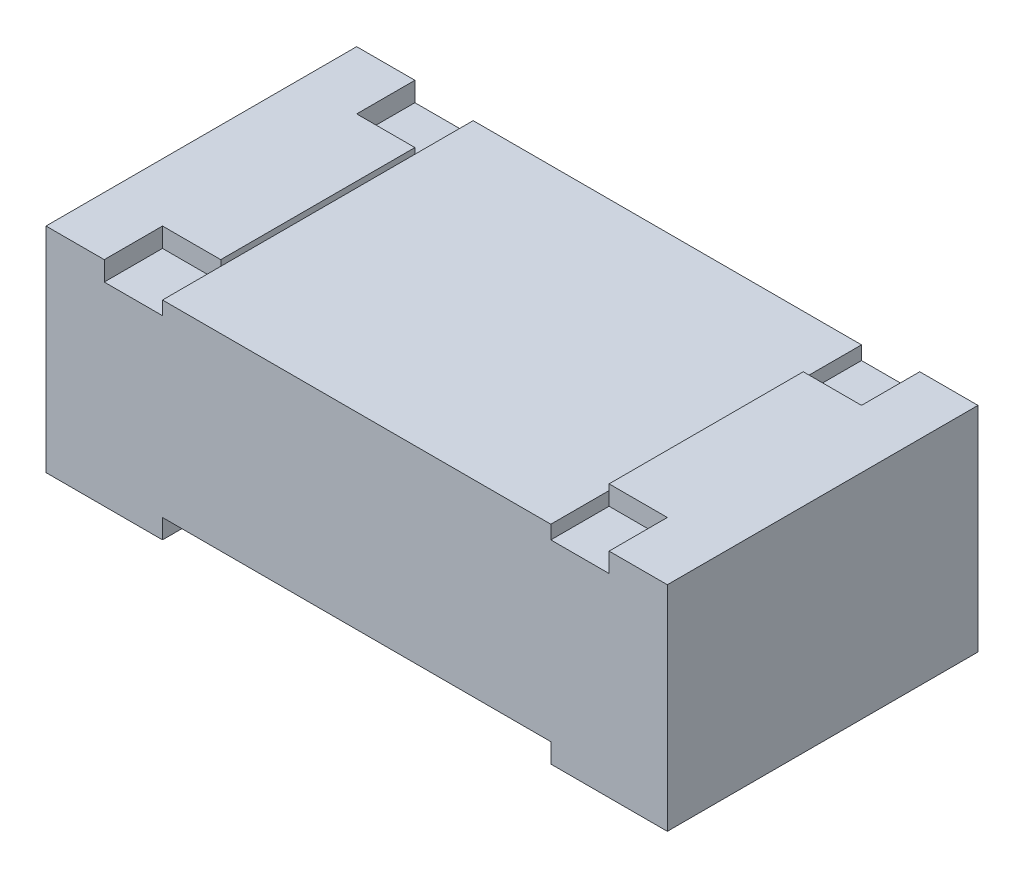
ISO-10303-21;
HEADER;
FILE_DESCRIPTION(('STEP AP214'),'2;1');
FILE_NAME('part.step','',(''),(''),'','','');
FILE_SCHEMA(('AUTOMOTIVE_DESIGN { 1 0 10303 214 1 1 1 1 }'));
ENDSEC;
DATA;
#1=APPLICATION_CONTEXT('core data for automotive mechanical design processes');
#2=APPLICATION_PROTOCOL_DEFINITION('international standard','automotive_design',2000,#1);
#3=PRODUCT_CONTEXT('',#1,'mechanical');
#4=PRODUCT('Part','Part','',(#3));
#5=PRODUCT_RELATED_PRODUCT_CATEGORY('part','',(#4));
#6=PRODUCT_DEFINITION_FORMATION('','',#4);
#7=PRODUCT_DEFINITION_CONTEXT('part definition',#1,'design');
#8=PRODUCT_DEFINITION('design','',#6,#7);
#9=PRODUCT_DEFINITION_SHAPE('','',#8);
#10=(LENGTH_UNIT() NAMED_UNIT(*) SI_UNIT(.MILLI.,.METRE.));
#11=(NAMED_UNIT(*) PLANE_ANGLE_UNIT() SI_UNIT($,.RADIAN.));
#12=(NAMED_UNIT(*) SI_UNIT($,.STERADIAN.) SOLID_ANGLE_UNIT());
#13=UNCERTAINTY_MEASURE_WITH_UNIT(LENGTH_MEASURE(1.E-05),#10,'distance_accuracy_value','');
#14=(GEOMETRIC_REPRESENTATION_CONTEXT(3) GLOBAL_UNCERTAINTY_ASSIGNED_CONTEXT((#13)) GLOBAL_UNIT_ASSIGNED_CONTEXT((#10,
#11,#12)) REPRESENTATION_CONTEXT('',''));
#15=CARTESIAN_POINT('',(0.,0.,0.));
#16=DIRECTION('',(0.,0.,1.));
#17=DIRECTION('',(1.,0.,0.));
#18=AXIS2_PLACEMENT_3D('',#15,#16,#17);
#19=CARTESIAN_POINT('',(12.865,1.58166,-42.3100019669656));
#20=DIRECTION('',(0.,-1.,0.));
#21=DIRECTION('',(1.,0.,0.));
#22=AXIS2_PLACEMENT_3D('',#19,#20,#21);
#23=PLANE('',#22);
#24=DIRECTION('',(0.,0.,1.));
#25=VECTOR('',#24,1.);
#26=CARTESIAN_POINT('',(12.565,1.58166,-42.3100019669656));
#27=LINE('',#26,#25);
#28=CARTESIAN_POINT('',(12.565,1.58166,-42.3100019669656));
#29=VERTEX_POINT('',#28);
#30=CARTESIAN_POINT('',(12.565,1.58166,-41.5100019669656));
#31=VERTEX_POINT('',#30);
#32=EDGE_CURVE('E19',#29,#31,#27,.T.);
#33=ORIENTED_EDGE('',*,*,#32,.F.);
#34=DIRECTION('',(-1.,0.,0.));
#35=VECTOR('',#34,1.);
#36=CARTESIAN_POINT('',(12.565,1.58166,-42.3100019669656));
#37=LINE('',#36,#35);
#38=CARTESIAN_POINT('',(12.865,1.58166,-42.3100019669656));
#39=VERTEX_POINT('',#38);
#40=EDGE_CURVE('E295',#39,#29,#37,.T.);
#41=ORIENTED_EDGE('',*,*,#40,.F.);
#42=DIRECTION('',(0.,0.,-1.));
#43=VECTOR('',#42,1.);
#44=CARTESIAN_POINT('',(12.865,1.58166,-42.3100019669656));
#45=LINE('',#44,#43);
#46=CARTESIAN_POINT('',(12.865,1.58166,-41.5100019669656));
#47=VERTEX_POINT('',#46);
#48=EDGE_CURVE('E305',#47,#39,#45,.T.);
#49=ORIENTED_EDGE('',*,*,#48,.F.);
#50=DIRECTION('',(-1.,0.,0.));
#51=VECTOR('',#50,1.);
#52=CARTESIAN_POINT('',(12.565,1.58166,-41.5100019669656));
#53=LINE('',#52,#51);
#54=EDGE_CURVE('E231',#47,#31,#53,.T.);
#55=ORIENTED_EDGE('',*,*,#54,.T.);
#56=EDGE_LOOP('',(#33,#41,#49,#55));
#57=FACE_BOUND('',#56,.T.);
#58=ADVANCED_FACE('F16',(#57),#23,.T.);
#59=CARTESIAN_POINT('',(12.565,1.58166,-42.3100019669656));
#60=DIRECTION('',(-1.,0.,0.));
#61=DIRECTION('',(0.,0.,1.));
#62=AXIS2_PLACEMENT_3D('',#59,#60,#61);
#63=PLANE('',#62);
#64=DIRECTION('',(0.,0.,1.));
#65=VECTOR('',#64,1.);
#66=CARTESIAN_POINT('',(12.565,1.63166,-42.3100019669656));
#67=LINE('',#66,#65);
#68=CARTESIAN_POINT('',(12.565,1.63166,-42.3100019669656));
#69=VERTEX_POINT('',#68);
#70=CARTESIAN_POINT('',(12.565,1.63166,-41.5100019669656));
#71=VERTEX_POINT('',#70);
#72=EDGE_CURVE('E247',#69,#71,#67,.T.);
#73=ORIENTED_EDGE('',*,*,#72,.F.);
#74=DIRECTION('',(0.,1.,0.));
#75=VECTOR('',#74,1.);
#76=CARTESIAN_POINT('',(12.565,1.58166,-42.3100019669656));
#77=LINE('',#76,#75);
#78=EDGE_CURVE('E226',#29,#69,#77,.T.);
#79=ORIENTED_EDGE('',*,*,#78,.F.);
#80=ORIENTED_EDGE('',*,*,#32,.T.);
#81=DIRECTION('',(0.,1.,0.));
#82=VECTOR('',#81,1.);
#83=CARTESIAN_POINT('',(12.565,1.58166,-41.5100019669656));
#84=LINE('',#83,#82);
#85=EDGE_CURVE('E223',#31,#71,#84,.T.);
#86=ORIENTED_EDGE('',*,*,#85,.T.);
#87=EDGE_LOOP('',(#73,#79,#80,#86));
#88=FACE_BOUND('',#87,.T.);
#89=ADVANCED_FACE('F222',(#88),#63,.T.);
#90=CARTESIAN_POINT('',(11.265,1.58166,-42.3100019669656));
#91=DIRECTION('',(0.,-1.,0.));
#92=DIRECTION('',(1.,0.,0.));
#93=AXIS2_PLACEMENT_3D('',#90,#91,#92);
#94=PLANE('',#93);
#95=DIRECTION('',(0.,0.,1.));
#96=VECTOR('',#95,1.);
#97=CARTESIAN_POINT('',(11.265,1.58166,-42.3100019669656));
#98=LINE('',#97,#96);
#99=CARTESIAN_POINT('',(11.265,1.58166,-42.3100019669656));
#100=VERTEX_POINT('',#99);
#101=CARTESIAN_POINT('',(11.265,1.58166,-41.5100019669656));
#102=VERTEX_POINT('',#101);
#103=EDGE_CURVE('E192',#100,#102,#98,.T.);
#104=ORIENTED_EDGE('',*,*,#103,.F.);
#105=DIRECTION('',(1.,0.,0.));
#106=VECTOR('',#105,1.);
#107=CARTESIAN_POINT('',(11.565,1.58166,-42.3100019669656));
#108=LINE('',#107,#106);
#109=CARTESIAN_POINT('',(11.565,1.58166,-42.3100019669656));
#110=VERTEX_POINT('',#109);
#111=EDGE_CURVE('E291',#100,#110,#108,.T.);
#112=ORIENTED_EDGE('',*,*,#111,.T.);
#113=DIRECTION('',(0.,0.,-1.));
#114=VECTOR('',#113,1.);
#115=CARTESIAN_POINT('',(11.565,1.58166,-42.3100019669656));
#116=LINE('',#115,#114);
#117=CARTESIAN_POINT('',(11.565,1.58166,-41.5100019669656));
#118=VERTEX_POINT('',#117);
#119=EDGE_CURVE('E187',#118,#110,#116,.T.);
#120=ORIENTED_EDGE('',*,*,#119,.F.);
#121=DIRECTION('',(1.,0.,0.));
#122=VECTOR('',#121,1.);
#123=CARTESIAN_POINT('',(11.565,1.58166,-41.5100019669656));
#124=LINE('',#123,#122);
#125=EDGE_CURVE('E203',#102,#118,#124,.T.);
#126=ORIENTED_EDGE('',*,*,#125,.F.);
#127=EDGE_LOOP('',(#104,#112,#120,#126));
#128=FACE_BOUND('',#127,.T.);
#129=ADVANCED_FACE('F204',(#128),#94,.T.);
#130=CARTESIAN_POINT('',(11.565,1.58166,-42.3100019669656));
#131=DIRECTION('',(1.,0.,0.));
#132=DIRECTION('',(0.,0.,-1.));
#133=AXIS2_PLACEMENT_3D('',#130,#131,#132);
#134=PLANE('',#133);
#135=ORIENTED_EDGE('',*,*,#119,.T.);
#136=DIRECTION('',(0.,1.,0.));
#137=VECTOR('',#136,1.);
#138=CARTESIAN_POINT('',(11.565,2.08166,-42.3100019669656));
#139=LINE('',#138,#137);
#140=CARTESIAN_POINT('',(11.565,1.63166,-42.3100019669656));
#141=VERTEX_POINT('',#140);
#142=EDGE_CURVE('E289',#110,#141,#139,.T.);
#143=ORIENTED_EDGE('',*,*,#142,.T.);
#144=DIRECTION('',(0.,0.,1.));
#145=VECTOR('',#144,1.);
#146=CARTESIAN_POINT('',(11.565,1.63166,-42.3100019669656));
#147=LINE('',#146,#145);
#148=CARTESIAN_POINT('',(11.565,1.63166,-41.5100019669656));
#149=VERTEX_POINT('',#148);
#150=EDGE_CURVE('E245',#149,#141,#147,.F.);
#151=ORIENTED_EDGE('',*,*,#150,.F.);
#152=DIRECTION('',(0.,1.,0.));
#153=VECTOR('',#152,1.);
#154=CARTESIAN_POINT('',(11.565,2.08166,-41.5100019669656));
#155=LINE('',#154,#153);
#156=EDGE_CURVE('E207',#118,#149,#155,.T.);
#157=ORIENTED_EDGE('',*,*,#156,.F.);
#158=EDGE_LOOP('',(#135,#143,#151,#157));
#159=FACE_BOUND('',#158,.T.);
#160=ADVANCED_FACE('F489',(#159),#134,.T.);
#161=CARTESIAN_POINT('',(11.415,2.08166,-42.3100019669656));
#162=DIRECTION('',(-1.,0.,0.));
#163=DIRECTION('',(0.,0.,1.));
#164=AXIS2_PLACEMENT_3D('',#161,#162,#163);
#165=PLANE('',#164);
#166=DIRECTION('',(0.,1.,0.));
#167=VECTOR('',#166,1.);
#168=CARTESIAN_POINT('',(11.415,2.08166,-42.1600019669656));
#169=LINE('',#168,#167);
#170=CARTESIAN_POINT('',(11.415,2.13166,-42.1600019669656));
#171=VERTEX_POINT('',#170);
#172=CARTESIAN_POINT('',(11.415,2.08166,-42.1600019669656));
#173=VERTEX_POINT('',#172);
#174=EDGE_CURVE('E282',#171,#173,#169,.F.);
#175=ORIENTED_EDGE('',*,*,#174,.T.);
#176=DIRECTION('',(0.,0.,1.));
#177=VECTOR('',#176,1.);
#178=CARTESIAN_POINT('',(11.415,2.08166,-42.3100019669656));
#179=LINE('',#178,#177);
#180=CARTESIAN_POINT('',(11.415,2.08166,-42.3100019669656));
#181=VERTEX_POINT('',#180);
#182=EDGE_CURVE('E284',#181,#173,#179,.T.);
#183=ORIENTED_EDGE('',*,*,#182,.F.);
#184=DIRECTION('',(0.,1.,0.));
#185=VECTOR('',#184,1.);
#186=CARTESIAN_POINT('',(11.415,2.08166,-42.3100019669656));
#187=LINE('',#186,#185);
#188=CARTESIAN_POINT('',(11.415,2.13166,-42.3100019669656));
#189=VERTEX_POINT('',#188);
#190=EDGE_CURVE('E287',#181,#189,#187,.T.);
#191=ORIENTED_EDGE('',*,*,#190,.T.);
#192=DIRECTION('',(0.,0.,1.));
#193=VECTOR('',#192,1.);
#194=CARTESIAN_POINT('',(11.415,2.13166,-42.3100019669656));
#195=LINE('',#194,#193);
#196=EDGE_CURVE('E274',#171,#189,#195,.F.);
#197=ORIENTED_EDGE('',*,*,#196,.F.);
#198=EDGE_LOOP('',(#175,#183,#191,#197));
#199=FACE_BOUND('',#198,.T.);
#200=ADVANCED_FACE('F491',(#199),#165,.F.);
#201=CARTESIAN_POINT('',(11.265,2.13166,-42.3100019669656));
#202=DIRECTION('',(-1.,0.,0.));
#203=DIRECTION('',(0.,0.,1.));
#204=AXIS2_PLACEMENT_3D('',#201,#202,#203);
#205=PLANE('',#204);
#206=DIRECTION('',(0.,0.,1.));
#207=VECTOR('',#206,1.);
#208=CARTESIAN_POINT('',(11.265,2.13166,-42.3100019669656));
#209=LINE('',#208,#207);
#210=CARTESIAN_POINT('',(11.265,2.13166,-42.3100019669656));
#211=VERTEX_POINT('',#210);
#212=CARTESIAN_POINT('',(11.265,2.13166,-41.5100019669656));
#213=VERTEX_POINT('',#212);
#214=EDGE_CURVE('E269',#211,#213,#209,.T.);
#215=ORIENTED_EDGE('',*,*,#214,.F.);
#216=DIRECTION('',(0.,1.,0.));
#217=VECTOR('',#216,1.);
#218=CARTESIAN_POINT('',(11.265,2.08166,-42.3100019669656));
#219=LINE('',#218,#217);
#220=EDGE_CURVE('E198',#211,#100,#219,.F.);
#221=ORIENTED_EDGE('',*,*,#220,.T.);
#222=ORIENTED_EDGE('',*,*,#103,.T.);
#223=DIRECTION('',(0.,1.,0.));
#224=VECTOR('',#223,1.);
#225=CARTESIAN_POINT('',(11.265,2.08166,-41.5100019669656));
#226=LINE('',#225,#224);
#227=EDGE_CURVE('E196',#213,#102,#226,.F.);
#228=ORIENTED_EDGE('',*,*,#227,.F.);
#229=EDGE_LOOP('',(#215,#221,#222,#228));
#230=FACE_BOUND('',#229,.T.);
#231=ADVANCED_FACE('F194',(#230),#205,.T.);
#232=CARTESIAN_POINT('',(11.415,2.08166,-41.5100019669656));
#233=DIRECTION('',(-1.,0.,0.));
#234=DIRECTION('',(0.,0.,1.));
#235=AXIS2_PLACEMENT_3D('',#232,#233,#234);
#236=PLANE('',#235);
#237=DIRECTION('',(0.,1.,0.));
#238=VECTOR('',#237,1.);
#239=CARTESIAN_POINT('',(11.415,2.08166,-41.5100019669656));
#240=LINE('',#239,#238);
#241=CARTESIAN_POINT('',(11.415,2.08166,-41.5100019669656));
#242=VERTEX_POINT('',#241);
#243=CARTESIAN_POINT('',(11.415,2.13166,-41.5100019669656));
#244=VERTEX_POINT('',#243);
#245=EDGE_CURVE('E200',#242,#244,#240,.T.);
#246=ORIENTED_EDGE('',*,*,#245,.F.);
#247=DIRECTION('',(0.,0.,1.));
#248=VECTOR('',#247,1.);
#249=CARTESIAN_POINT('',(11.415,2.08166,-42.3100019669656));
#250=LINE('',#249,#248);
#251=CARTESIAN_POINT('',(11.415,2.08166,-41.6600019669656));
#252=VERTEX_POINT('',#251);
#253=EDGE_CURVE('E249',#252,#242,#250,.T.);
#254=ORIENTED_EDGE('',*,*,#253,.F.);
#255=DIRECTION('',(0.,1.,0.));
#256=VECTOR('',#255,1.);
#257=CARTESIAN_POINT('',(11.415,2.08166,-41.6600019669656));
#258=LINE('',#257,#256);
#259=CARTESIAN_POINT('',(11.415,2.13166,-41.6600019669656));
#260=VERTEX_POINT('',#259);
#261=EDGE_CURVE('E263',#252,#260,#258,.T.);
#262=ORIENTED_EDGE('',*,*,#261,.T.);
#263=DIRECTION('',(0.,0.,1.));
#264=VECTOR('',#263,1.);
#265=CARTESIAN_POINT('',(11.415,2.13166,-42.3100019669656));
#266=LINE('',#265,#264);
#267=EDGE_CURVE('E265',#244,#260,#266,.F.);
#268=ORIENTED_EDGE('',*,*,#267,.F.);
#269=EDGE_LOOP('',(#246,#254,#262,#268));
#270=FACE_BOUND('',#269,.T.);
#271=ADVANCED_FACE('F483',(#270),#236,.F.);
#272=CARTESIAN_POINT('',(12.715,2.08166,-41.5100019669656));
#273=DIRECTION('',(1.,0.,0.));
#274=DIRECTION('',(0.,0.,-1.));
#275=AXIS2_PLACEMENT_3D('',#272,#273,#274);
#276=PLANE('',#275);
#277=DIRECTION('',(0.,1.,0.));
#278=VECTOR('',#277,1.);
#279=CARTESIAN_POINT('',(12.715,2.08166,-41.6600019669656));
#280=LINE('',#279,#278);
#281=CARTESIAN_POINT('',(12.715,2.13166,-41.6600019669656));
#282=VERTEX_POINT('',#281);
#283=CARTESIAN_POINT('',(12.715,2.08166,-41.6600019669656));
#284=VERTEX_POINT('',#283);
#285=EDGE_CURVE('E335',#282,#284,#280,.F.);
#286=ORIENTED_EDGE('',*,*,#285,.T.);
#287=DIRECTION('',(0.,0.,1.));
#288=VECTOR('',#287,1.);
#289=CARTESIAN_POINT('',(12.715,2.08166,-42.3100019669656));
#290=LINE('',#289,#288);
#291=CARTESIAN_POINT('',(12.715,2.08166,-41.5100019669656));
#292=VERTEX_POINT('',#291);
#293=EDGE_CURVE('E252',#292,#284,#290,.F.);
#294=ORIENTED_EDGE('',*,*,#293,.F.);
#295=DIRECTION('',(0.,1.,0.));
#296=VECTOR('',#295,1.);
#297=CARTESIAN_POINT('',(12.715,1.58166,-41.5100019669656));
#298=LINE('',#297,#296);
#299=CARTESIAN_POINT('',(12.715,2.13166,-41.5100019669656));
#300=VERTEX_POINT('',#299);
#301=EDGE_CURVE('E235',#292,#300,#298,.T.);
#302=ORIENTED_EDGE('',*,*,#301,.T.);
#303=DIRECTION('',(0.,0.,1.));
#304=VECTOR('',#303,1.);
#305=CARTESIAN_POINT('',(12.715,2.13166,-42.3100019669656));
#306=LINE('',#305,#304);
#307=EDGE_CURVE('E318',#282,#300,#306,.T.);
#308=ORIENTED_EDGE('',*,*,#307,.F.);
#309=EDGE_LOOP('',(#286,#294,#302,#308));
#310=FACE_BOUND('',#309,.T.);
#311=ADVANCED_FACE('F553',(#310),#276,.F.);
#312=CARTESIAN_POINT('',(12.865,2.13166,-42.3100019669656));
#313=DIRECTION('',(1.,0.,0.));
#314=DIRECTION('',(0.,0.,-1.));
#315=AXIS2_PLACEMENT_3D('',#312,#313,#314);
#316=PLANE('',#315);
#317=ORIENTED_EDGE('',*,*,#48,.T.);
#318=DIRECTION('',(0.,1.,0.));
#319=VECTOR('',#318,1.);
#320=CARTESIAN_POINT('',(12.865,1.58166,-42.3100019669656));
#321=LINE('',#320,#319);
#322=CARTESIAN_POINT('',(12.865,2.13166,-42.3100019669656));
#323=VERTEX_POINT('',#322);
#324=EDGE_CURVE('E297',#323,#39,#321,.F.);
#325=ORIENTED_EDGE('',*,*,#324,.F.);
#326=DIRECTION('',(0.,0.,1.));
#327=VECTOR('',#326,1.);
#328=CARTESIAN_POINT('',(12.865,2.13166,-42.3100019669656));
#329=LINE('',#328,#327);
#330=CARTESIAN_POINT('',(12.865,2.13166,-41.5100019669656));
#331=VERTEX_POINT('',#330);
#332=EDGE_CURVE('E311',#331,#323,#329,.F.);
#333=ORIENTED_EDGE('',*,*,#332,.F.);
#334=DIRECTION('',(0.,1.,0.));
#335=VECTOR('',#334,1.);
#336=CARTESIAN_POINT('',(12.865,2.13166,-41.5100019669656));
#337=LINE('',#336,#335);
#338=EDGE_CURVE('E237',#331,#47,#337,.F.);
#339=ORIENTED_EDGE('',*,*,#338,.T.);
#340=EDGE_LOOP('',(#317,#325,#333,#339));
#341=FACE_BOUND('',#340,.T.);
#342=ADVANCED_FACE('F309',(#341),#316,.T.);
#343=CARTESIAN_POINT('',(12.715,2.08166,-42.3100019669656));
#344=DIRECTION('',(1.,0.,0.));
#345=DIRECTION('',(0.,0.,-1.));
#346=AXIS2_PLACEMENT_3D('',#343,#344,#345);
#347=PLANE('',#346);
#348=DIRECTION('',(0.,1.,0.));
#349=VECTOR('',#348,1.);
#350=CARTESIAN_POINT('',(12.715,1.58166,-42.3100019669656));
#351=LINE('',#350,#349);
#352=CARTESIAN_POINT('',(12.715,2.08166,-42.3100019669656));
#353=VERTEX_POINT('',#352);
#354=CARTESIAN_POINT('',(12.715,2.13166,-42.3100019669656));
#355=VERTEX_POINT('',#354);
#356=EDGE_CURVE('E300',#353,#355,#351,.T.);
#357=ORIENTED_EDGE('',*,*,#356,.F.);
#358=DIRECTION('',(0.,0.,1.));
#359=VECTOR('',#358,1.);
#360=CARTESIAN_POINT('',(12.715,2.08166,-42.3100019669656));
#361=LINE('',#360,#359);
#362=CARTESIAN_POINT('',(12.715,2.08166,-42.1600019669656));
#363=VERTEX_POINT('',#362);
#364=EDGE_CURVE('E400',#363,#353,#361,.F.);
#365=ORIENTED_EDGE('',*,*,#364,.F.);
#366=DIRECTION('',(0.,1.,0.));
#367=VECTOR('',#366,1.);
#368=CARTESIAN_POINT('',(12.715,2.08166,-42.1600019669656));
#369=LINE('',#368,#367);
#370=CARTESIAN_POINT('',(12.715,2.13166,-42.1600019669656));
#371=VERTEX_POINT('',#370);
#372=EDGE_CURVE('E405',#363,#371,#369,.T.);
#373=ORIENTED_EDGE('',*,*,#372,.T.);
#374=DIRECTION('',(0.,0.,1.));
#375=VECTOR('',#374,1.);
#376=CARTESIAN_POINT('',(12.715,2.13166,-42.3100019669656));
#377=LINE('',#376,#375);
#378=EDGE_CURVE('E327',#355,#371,#377,.T.);
#379=ORIENTED_EDGE('',*,*,#378,.F.);
#380=EDGE_LOOP('',(#357,#365,#373,#379));
#381=FACE_BOUND('',#380,.T.);
#382=ADVANCED_FACE('F415',(#381),#347,.F.);
#383=CARTESIAN_POINT('',(11.315,1.63166,-42.3100019669656));
#384=DIRECTION('',(0.,-1.,0.));
#385=DIRECTION('',(1.,0.,0.));
#386=AXIS2_PLACEMENT_3D('',#383,#384,#385);
#387=PLANE('',#386);
#388=ORIENTED_EDGE('',*,*,#150,.T.);
#389=DIRECTION('',(1.,0.,0.));
#390=VECTOR('',#389,1.);
#391=CARTESIAN_POINT('',(11.315,1.63166,-42.3100019669656));
#392=LINE('',#391,#390);
#393=EDGE_CURVE('E395',#141,#69,#392,.T.);
#394=ORIENTED_EDGE('',*,*,#393,.T.);
#395=ORIENTED_EDGE('',*,*,#72,.T.);
#396=DIRECTION('',(1.,0.,0.));
#397=VECTOR('',#396,1.);
#398=CARTESIAN_POINT('',(11.315,1.63166,-41.5100019669656));
#399=LINE('',#398,#397);
#400=EDGE_CURVE('E234',#149,#71,#399,.T.);
#401=ORIENTED_EDGE('',*,*,#400,.F.);
#402=EDGE_LOOP('',(#388,#394,#395,#401));
#403=FACE_BOUND('',#402,.T.);
#404=ADVANCED_FACE('F243',(#403),#387,.T.);
#405=CARTESIAN_POINT('',(11.315,2.08166,-42.3100019669656));
#406=DIRECTION('',(0.,1.,0.));
#407=DIRECTION('',(-1.,0.,0.));
#408=AXIS2_PLACEMENT_3D('',#405,#406,#407);
#409=PLANE('',#408);
#410=DIRECTION('',(1.,0.,0.));
#411=VECTOR('',#410,1.);
#412=CARTESIAN_POINT('',(11.315,2.08166,-42.3100019669656));
#413=LINE('',#412,#411);
#414=CARTESIAN_POINT('',(11.565,2.08166,-42.3100019669656));
#415=VERTEX_POINT('',#414);
#416=EDGE_CURVE('E390',#415,#181,#413,.F.);
#417=ORIENTED_EDGE('',*,*,#416,.T.);
#418=ORIENTED_EDGE('',*,*,#182,.T.);
#419=DIRECTION('',(1.,0.,0.));
#420=VECTOR('',#419,1.);
#421=CARTESIAN_POINT('',(11.415,2.08166,-42.1600019669656));
#422=LINE('',#421,#420);
#423=CARTESIAN_POINT('',(11.565,2.08166,-42.1600019669656));
#424=VERTEX_POINT('',#423);
#425=EDGE_CURVE('E280',#173,#424,#422,.T.);
#426=ORIENTED_EDGE('',*,*,#425,.T.);
#427=DIRECTION('',(0.,0.,1.));
#428=VECTOR('',#427,1.);
#429=CARTESIAN_POINT('',(11.565,2.08166,-42.3100019669656));
#430=LINE('',#429,#428);
#431=EDGE_CURVE('E384',#415,#424,#430,.T.);
#432=ORIENTED_EDGE('',*,*,#431,.F.);
#433=EDGE_LOOP('',(#417,#418,#426,#432));
#434=FACE_BOUND('',#433,.T.);
#435=ADVANCED_FACE('F543',(#434),#409,.T.);
#436=CARTESIAN_POINT('',(11.415,2.08166,-42.1600019669656));
#437=DIRECTION('',(0.,0.,1.));
#438=DIRECTION('',(1.,0.,0.));
#439=AXIS2_PLACEMENT_3D('',#436,#437,#438);
#440=PLANE('',#439);
#441=DIRECTION('',(0.,1.,0.));
#442=VECTOR('',#441,1.);
#443=CARTESIAN_POINT('',(11.565,2.11666,-42.1600019669656));
#444=LINE('',#443,#442);
#445=CARTESIAN_POINT('',(11.565,2.11666,-42.1600019669656));
#446=VERTEX_POINT('',#445);
#447=EDGE_CURVE('E387',#424,#446,#444,.T.);
#448=ORIENTED_EDGE('',*,*,#447,.F.);
#449=ORIENTED_EDGE('',*,*,#425,.F.);
#450=ORIENTED_EDGE('',*,*,#174,.F.);
#451=DIRECTION('',(-1.,0.,0.));
#452=VECTOR('',#451,1.);
#453=CARTESIAN_POINT('',(11.565,2.13166,-42.1600019669656));
#454=LINE('',#453,#452);
#455=CARTESIAN_POINT('',(11.565,2.13166,-42.1600019669656));
#456=VERTEX_POINT('',#455);
#457=EDGE_CURVE('E277',#456,#171,#454,.T.);
#458=ORIENTED_EDGE('',*,*,#457,.F.);
#459=DIRECTION('',(0.,1.,0.));
#460=VECTOR('',#459,1.);
#461=CARTESIAN_POINT('',(11.565,2.13166,-42.1600019669656));
#462=LINE('',#461,#460);
#463=EDGE_CURVE('E381',#446,#456,#462,.T.);
#464=ORIENTED_EDGE('',*,*,#463,.F.);
#465=EDGE_LOOP('',(#448,#449,#450,#458,#464));
#466=FACE_BOUND('',#465,.T.);
#467=ADVANCED_FACE('F540',(#466),#440,.F.);
#468=CARTESIAN_POINT('',(11.565,2.13166,-42.3100019669656));
#469=DIRECTION('',(0.,1.,0.));
#470=DIRECTION('',(-1.,0.,0.));
#471=AXIS2_PLACEMENT_3D('',#468,#469,#470);
#472=PLANE('',#471);
#473=DIRECTION('',(-1.,0.,0.));
#474=VECTOR('',#473,1.);
#475=CARTESIAN_POINT('',(11.415,2.13166,-41.6600019669656));
#476=LINE('',#475,#474);
#477=CARTESIAN_POINT('',(11.565,2.13166,-41.6600019669656));
#478=VERTEX_POINT('',#477);
#479=EDGE_CURVE('E261',#260,#478,#476,.F.);
#480=ORIENTED_EDGE('',*,*,#479,.T.);
#481=DIRECTION('',(0.,0.,-1.));
#482=VECTOR('',#481,1.);
#483=CARTESIAN_POINT('',(11.565,2.13166,-42.3100019669656));
#484=LINE('',#483,#482);
#485=EDGE_CURVE('E378',#456,#478,#484,.F.);
#486=ORIENTED_EDGE('',*,*,#485,.F.);
#487=ORIENTED_EDGE('',*,*,#457,.T.);
#488=ORIENTED_EDGE('',*,*,#196,.T.);
#489=DIRECTION('',(-1.,0.,0.));
#490=VECTOR('',#489,1.);
#491=CARTESIAN_POINT('',(11.565,2.13166,-42.3100019669656));
#492=LINE('',#491,#490);
#493=EDGE_CURVE('E271',#189,#211,#492,.T.);
#494=ORIENTED_EDGE('',*,*,#493,.T.);
#495=ORIENTED_EDGE('',*,*,#214,.T.);
#496=DIRECTION('',(-1.,0.,0.));
#497=VECTOR('',#496,1.);
#498=CARTESIAN_POINT('',(11.565,2.13166,-41.5100019669656));
#499=LINE('',#498,#497);
#500=EDGE_CURVE('E211',#213,#244,#499,.F.);
#501=ORIENTED_EDGE('',*,*,#500,.T.);
#502=ORIENTED_EDGE('',*,*,#267,.T.);
#503=EDGE_LOOP('',(#480,#486,#487,#488,#494,#495,#501,#502));
#504=FACE_BOUND('',#503,.T.);
#505=ADVANCED_FACE('F486',(#504),#472,.T.);
#506=CARTESIAN_POINT('',(11.415,2.08166,-41.6600019669656));
#507=DIRECTION('',(0.,0.,-1.));
#508=DIRECTION('',(-1.,0.,0.));
#509=AXIS2_PLACEMENT_3D('',#506,#507,#508);
#510=PLANE('',#509);
#511=DIRECTION('',(0.,1.,0.));
#512=VECTOR('',#511,1.);
#513=CARTESIAN_POINT('',(11.565,2.13166,-41.6600019669656));
#514=LINE('',#513,#512);
#515=CARTESIAN_POINT('',(11.565,2.11666,-41.6600019669656));
#516=VERTEX_POINT('',#515);
#517=EDGE_CURVE('E375',#478,#516,#514,.F.);
#518=ORIENTED_EDGE('',*,*,#517,.F.);
#519=ORIENTED_EDGE('',*,*,#479,.F.);
#520=ORIENTED_EDGE('',*,*,#261,.F.);
#521=DIRECTION('',(-1.,0.,0.));
#522=VECTOR('',#521,1.);
#523=CARTESIAN_POINT('',(11.315,2.08166,-41.6600019669656));
#524=LINE('',#523,#522);
#525=CARTESIAN_POINT('',(11.565,2.08166,-41.6600019669656));
#526=VERTEX_POINT('',#525);
#527=EDGE_CURVE('E255',#526,#252,#524,.T.);
#528=ORIENTED_EDGE('',*,*,#527,.F.);
#529=DIRECTION('',(0.,1.,0.));
#530=VECTOR('',#529,1.);
#531=CARTESIAN_POINT('',(11.565,2.11666,-41.6600019669656));
#532=LINE('',#531,#530);
#533=EDGE_CURVE('E372',#516,#526,#532,.F.);
#534=ORIENTED_EDGE('',*,*,#533,.F.);
#535=EDGE_LOOP('',(#518,#519,#520,#528,#534));
#536=FACE_BOUND('',#535,.T.);
#537=ADVANCED_FACE('F534',(#536),#510,.F.);
#538=CARTESIAN_POINT('',(11.315,2.08166,-42.3100019669656));
#539=DIRECTION('',(0.,1.,0.));
#540=DIRECTION('',(-1.,0.,0.));
#541=AXIS2_PLACEMENT_3D('',#538,#539,#540);
#542=PLANE('',#541);
#543=DIRECTION('',(1.,0.,0.));
#544=VECTOR('',#543,1.);
#545=CARTESIAN_POINT('',(11.315,2.08166,-41.5100019669656));
#546=LINE('',#545,#544);
#547=CARTESIAN_POINT('',(11.565,2.08166,-41.5100019669656));
#548=VERTEX_POINT('',#547);
#549=EDGE_CURVE('E248',#548,#242,#546,.F.);
#550=ORIENTED_EDGE('',*,*,#549,.F.);
#551=DIRECTION('',(0.,0.,1.));
#552=VECTOR('',#551,1.);
#553=CARTESIAN_POINT('',(11.565,2.08166,-42.3100019669656));
#554=LINE('',#553,#552);
#555=EDGE_CURVE('E369',#526,#548,#554,.T.);
#556=ORIENTED_EDGE('',*,*,#555,.F.);
#557=ORIENTED_EDGE('',*,*,#527,.T.);
#558=ORIENTED_EDGE('',*,*,#253,.T.);
#559=EDGE_LOOP('',(#550,#556,#557,#558));
#560=FACE_BOUND('',#559,.T.);
#561=ADVANCED_FACE('F480',(#560),#542,.T.);
#562=CARTESIAN_POINT('',(11.315,2.08166,-42.3100019669656));
#563=DIRECTION('',(0.,1.,0.));
#564=DIRECTION('',(-1.,0.,0.));
#565=AXIS2_PLACEMENT_3D('',#562,#563,#564);
#566=PLANE('',#565);
#567=DIRECTION('',(0.,0.,-1.));
#568=VECTOR('',#567,1.);
#569=CARTESIAN_POINT('',(12.565,2.08166,-42.3100019669656));
#570=LINE('',#569,#568);
#571=CARTESIAN_POINT('',(12.565,2.08166,-41.5100019669656));
#572=VERTEX_POINT('',#571);
#573=CARTESIAN_POINT('',(12.565,2.08166,-41.6600019669656));
#574=VERTEX_POINT('',#573);
#575=EDGE_CURVE('E359',#572,#574,#570,.T.);
#576=ORIENTED_EDGE('',*,*,#575,.F.);
#577=DIRECTION('',(-1.,0.,0.));
#578=VECTOR('',#577,1.);
#579=CARTESIAN_POINT('',(11.315,2.08166,-41.5100019669656));
#580=LINE('',#579,#578);
#581=EDGE_CURVE('E337',#572,#292,#580,.F.);
#582=ORIENTED_EDGE('',*,*,#581,.T.);
#583=ORIENTED_EDGE('',*,*,#293,.T.);
#584=DIRECTION('',(-1.,0.,0.));
#585=VECTOR('',#584,1.);
#586=CARTESIAN_POINT('',(11.415,2.08166,-41.6600019669656));
#587=LINE('',#586,#585);
#588=EDGE_CURVE('E333',#284,#574,#587,.T.);
#589=ORIENTED_EDGE('',*,*,#588,.T.);
#590=EDGE_LOOP('',(#576,#582,#583,#589));
#591=FACE_BOUND('',#590,.T.);
#592=ADVANCED_FACE('F343',(#591),#566,.T.);
#593=CARTESIAN_POINT('',(11.415,2.08166,-41.6600019669656));
#594=DIRECTION('',(0.,0.,-1.));
#595=DIRECTION('',(-1.,0.,0.));
#596=AXIS2_PLACEMENT_3D('',#593,#594,#595);
#597=PLANE('',#596);
#598=DIRECTION('',(0.,1.,0.));
#599=VECTOR('',#598,1.);
#600=CARTESIAN_POINT('',(12.565,2.11666,-41.6600019669656));
#601=LINE('',#600,#599);
#602=CARTESIAN_POINT('',(12.565,2.11666,-41.6600019669656));
#603=VERTEX_POINT('',#602);
#604=EDGE_CURVE('E348',#574,#603,#601,.T.);
#605=ORIENTED_EDGE('',*,*,#604,.F.);
#606=ORIENTED_EDGE('',*,*,#588,.F.);
#607=ORIENTED_EDGE('',*,*,#285,.F.);
#608=DIRECTION('',(-1.,0.,0.));
#609=VECTOR('',#608,1.);
#610=CARTESIAN_POINT('',(12.565,2.13166,-41.6600019669656));
#611=LINE('',#610,#609);
#612=CARTESIAN_POINT('',(12.565,2.13166,-41.6600019669656));
#613=VERTEX_POINT('',#612);
#614=EDGE_CURVE('E324',#613,#282,#611,.F.);
#615=ORIENTED_EDGE('',*,*,#614,.F.);
#616=DIRECTION('',(0.,1.,0.));
#617=VECTOR('',#616,1.);
#618=CARTESIAN_POINT('',(12.565,2.13166,-41.6600019669656));
#619=LINE('',#618,#617);
#620=EDGE_CURVE('E351',#603,#613,#619,.T.);
#621=ORIENTED_EDGE('',*,*,#620,.F.);
#622=EDGE_LOOP('',(#605,#606,#607,#615,#621));
#623=FACE_BOUND('',#622,.T.);
#624=ADVANCED_FACE('F346',(#623),#597,.F.);
#625=CARTESIAN_POINT('',(12.565,2.13166,-42.3100019669656));
#626=DIRECTION('',(0.,1.,0.));
#627=DIRECTION('',(-1.,0.,0.));
#628=AXIS2_PLACEMENT_3D('',#625,#626,#627);
#629=PLANE('',#628);
#630=ORIENTED_EDGE('',*,*,#332,.T.);
#631=DIRECTION('',(-1.,0.,0.));
#632=VECTOR('',#631,1.);
#633=CARTESIAN_POINT('',(12.565,2.13166,-42.3100019669656));
#634=LINE('',#633,#632);
#635=EDGE_CURVE('E407',#323,#355,#634,.T.);
#636=ORIENTED_EDGE('',*,*,#635,.T.);
#637=ORIENTED_EDGE('',*,*,#378,.T.);
#638=DIRECTION('',(1.,0.,0.));
#639=VECTOR('',#638,1.);
#640=CARTESIAN_POINT('',(11.415,2.13166,-42.1600019669656));
#641=LINE('',#640,#639);
#642=CARTESIAN_POINT('',(12.565,2.13166,-42.1600019669656));
#643=VERTEX_POINT('',#642);
#644=EDGE_CURVE('E403',#371,#643,#641,.F.);
#645=ORIENTED_EDGE('',*,*,#644,.T.);
#646=DIRECTION('',(0.,0.,1.));
#647=VECTOR('',#646,1.);
#648=CARTESIAN_POINT('',(12.565,2.13166,-42.3100019669656));
#649=LINE('',#648,#647);
#650=EDGE_CURVE('E362',#613,#643,#649,.F.);
#651=ORIENTED_EDGE('',*,*,#650,.F.);
#652=ORIENTED_EDGE('',*,*,#614,.T.);
#653=ORIENTED_EDGE('',*,*,#307,.T.);
#654=DIRECTION('',(-1.,0.,0.));
#655=VECTOR('',#654,1.);
#656=CARTESIAN_POINT('',(12.565,2.13166,-41.5100019669656));
#657=LINE('',#656,#655);
#658=EDGE_CURVE('E314',#300,#331,#657,.F.);
#659=ORIENTED_EDGE('',*,*,#658,.T.);
#660=EDGE_LOOP('',(#630,#636,#637,#645,#651,#652,#653,#659));
#661=FACE_BOUND('',#660,.T.);
#662=ADVANCED_FACE('F322',(#661),#629,.T.);
#663=CARTESIAN_POINT('',(11.415,2.08166,-42.1600019669656));
#664=DIRECTION('',(0.,0.,1.));
#665=DIRECTION('',(1.,0.,0.));
#666=AXIS2_PLACEMENT_3D('',#663,#664,#665);
#667=PLANE('',#666);
#668=DIRECTION('',(0.,1.,0.));
#669=VECTOR('',#668,1.);
#670=CARTESIAN_POINT('',(12.565,2.13166,-42.1600019669656));
#671=LINE('',#670,#669);
#672=CARTESIAN_POINT('',(12.565,2.11666,-42.1600019669656));
#673=VERTEX_POINT('',#672);
#674=EDGE_CURVE('E427',#643,#673,#671,.F.);
#675=ORIENTED_EDGE('',*,*,#674,.F.);
#676=ORIENTED_EDGE('',*,*,#644,.F.);
#677=ORIENTED_EDGE('',*,*,#372,.F.);
#678=DIRECTION('',(-1.,0.,0.));
#679=VECTOR('',#678,1.);
#680=CARTESIAN_POINT('',(11.315,2.08166,-42.1600019669656));
#681=LINE('',#680,#679);
#682=CARTESIAN_POINT('',(12.565,2.08166,-42.1600019669656));
#683=VERTEX_POINT('',#682);
#684=EDGE_CURVE('E397',#683,#363,#681,.F.);
#685=ORIENTED_EDGE('',*,*,#684,.F.);
#686=DIRECTION('',(0.,1.,0.));
#687=VECTOR('',#686,1.);
#688=CARTESIAN_POINT('',(12.565,2.11666,-42.1600019669656));
#689=LINE('',#688,#687);
#690=EDGE_CURVE('E425',#673,#683,#689,.F.);
#691=ORIENTED_EDGE('',*,*,#690,.F.);
#692=EDGE_LOOP('',(#675,#676,#677,#685,#691));
#693=FACE_BOUND('',#692,.T.);
#694=ADVANCED_FACE('F424',(#693),#667,.F.);
#695=CARTESIAN_POINT('',(11.315,2.08166,-42.3100019669656));
#696=DIRECTION('',(0.,1.,0.));
#697=DIRECTION('',(-1.,0.,0.));
#698=AXIS2_PLACEMENT_3D('',#695,#696,#697);
#699=PLANE('',#698);
#700=DIRECTION('',(0.,0.,-1.));
#701=VECTOR('',#700,1.);
#702=CARTESIAN_POINT('',(12.565,2.08166,-42.3100019669656));
#703=LINE('',#702,#701);
#704=CARTESIAN_POINT('',(12.565,2.08166,-42.3100019669656));
#705=VERTEX_POINT('',#704);
#706=EDGE_CURVE('E420',#683,#705,#703,.T.);
#707=ORIENTED_EDGE('',*,*,#706,.F.);
#708=ORIENTED_EDGE('',*,*,#684,.T.);
#709=ORIENTED_EDGE('',*,*,#364,.T.);
#710=DIRECTION('',(1.,0.,0.));
#711=VECTOR('',#710,1.);
#712=CARTESIAN_POINT('',(11.315,2.08166,-42.3100019669656));
#713=LINE('',#712,#711);
#714=EDGE_CURVE('E393',#353,#705,#713,.F.);
#715=ORIENTED_EDGE('',*,*,#714,.T.);
#716=EDGE_LOOP('',(#707,#708,#709,#715));
#717=FACE_BOUND('',#716,.T.);
#718=ADVANCED_FACE('F419',(#717),#699,.T.);
#719=CARTESIAN_POINT('',(11.565,2.11666,-42.3100019669656));
#720=DIRECTION('',(-1.,0.,0.));
#721=DIRECTION('',(0.,0.,1.));
#722=AXIS2_PLACEMENT_3D('',#719,#720,#721);
#723=PLANE('',#722);
#724=DIRECTION('',(0.,1.,0.));
#725=VECTOR('',#724,1.);
#726=CARTESIAN_POINT('',(11.565,2.08166,-42.3100019669656));
#727=LINE('',#726,#725);
#728=CARTESIAN_POINT('',(11.565,2.11666,-42.3100019669656));
#729=VERTEX_POINT('',#728);
#730=EDGE_CURVE('E455',#729,#415,#727,.F.);
#731=ORIENTED_EDGE('',*,*,#730,.T.);
#732=ORIENTED_EDGE('',*,*,#431,.T.);
#733=ORIENTED_EDGE('',*,*,#447,.T.);
#734=DIRECTION('',(0.,0.,1.));
#735=VECTOR('',#734,1.);
#736=CARTESIAN_POINT('',(11.565,2.11666,-42.3100019669656));
#737=LINE('',#736,#735);
#738=EDGE_CURVE('E452',#729,#446,#737,.T.);
#739=ORIENTED_EDGE('',*,*,#738,.F.);
#740=EDGE_LOOP('',(#731,#732,#733,#739));
#741=FACE_BOUND('',#740,.T.);
#742=ADVANCED_FACE('F466',(#741),#723,.T.);
#743=CARTESIAN_POINT('',(11.565,2.13166,-42.3100019669656));
#744=DIRECTION('',(1.,0.,0.));
#745=DIRECTION('',(0.,0.,-1.));
#746=AXIS2_PLACEMENT_3D('',#743,#744,#745);
#747=PLANE('',#746);
#748=ORIENTED_EDGE('',*,*,#485,.T.);
#749=ORIENTED_EDGE('',*,*,#517,.T.);
#750=DIRECTION('',(0.,0.,1.));
#751=VECTOR('',#750,1.);
#752=CARTESIAN_POINT('',(11.565,2.11666,-42.3100019669656));
#753=LINE('',#752,#751);
#754=EDGE_CURVE('E449',#446,#516,#753,.T.);
#755=ORIENTED_EDGE('',*,*,#754,.F.);
#756=ORIENTED_EDGE('',*,*,#463,.T.);
#757=EDGE_LOOP('',(#748,#749,#755,#756));
#758=FACE_BOUND('',#757,.T.);
#759=ADVANCED_FACE('F472',(#758),#747,.T.);
#760=CARTESIAN_POINT('',(11.565,2.11666,-42.3100019669656));
#761=DIRECTION('',(-1.,0.,0.));
#762=DIRECTION('',(0.,0.,1.));
#763=AXIS2_PLACEMENT_3D('',#760,#761,#762);
#764=PLANE('',#763);
#765=DIRECTION('',(0.,1.,0.));
#766=VECTOR('',#765,1.);
#767=CARTESIAN_POINT('',(11.565,2.08166,-41.5100019669656));
#768=LINE('',#767,#766);
#769=CARTESIAN_POINT('',(11.565,2.11666,-41.5100019669656));
#770=VERTEX_POINT('',#769);
#771=EDGE_CURVE('E356',#770,#548,#768,.F.);
#772=ORIENTED_EDGE('',*,*,#771,.F.);
#773=DIRECTION('',(0.,0.,1.));
#774=VECTOR('',#773,1.);
#775=CARTESIAN_POINT('',(11.565,2.11666,-42.3100019669656));
#776=LINE('',#775,#774);
#777=EDGE_CURVE('E444',#516,#770,#776,.T.);
#778=ORIENTED_EDGE('',*,*,#777,.F.);
#779=ORIENTED_EDGE('',*,*,#533,.T.);
#780=ORIENTED_EDGE('',*,*,#555,.T.);
#781=EDGE_LOOP('',(#772,#778,#779,#780));
#782=FACE_BOUND('',#781,.T.);
#783=ADVANCED_FACE('F476',(#782),#764,.T.);
#784=CARTESIAN_POINT('',(11.565,2.08166,-41.5100019669656));
#785=DIRECTION('',(0.,0.,1.));
#786=DIRECTION('',(1.,0.,0.));
#787=AXIS2_PLACEMENT_3D('',#784,#785,#786);
#788=PLANE('',#787);
#789=ORIENTED_EDGE('',*,*,#156,.T.);
#790=ORIENTED_EDGE('',*,*,#400,.T.);
#791=ORIENTED_EDGE('',*,*,#85,.F.);
#792=ORIENTED_EDGE('',*,*,#54,.F.);
#793=ORIENTED_EDGE('',*,*,#338,.F.);
#794=ORIENTED_EDGE('',*,*,#658,.F.);
#795=ORIENTED_EDGE('',*,*,#301,.F.);
#796=ORIENTED_EDGE('',*,*,#581,.F.);
#797=DIRECTION('',(0.,1.,0.));
#798=VECTOR('',#797,1.);
#799=CARTESIAN_POINT('',(12.565,2.11666,-41.5100019669656));
#800=LINE('',#799,#798);
#801=CARTESIAN_POINT('',(12.565,2.11666,-41.5100019669656));
#802=VERTEX_POINT('',#801);
#803=EDGE_CURVE('E355',#802,#572,#800,.F.);
#804=ORIENTED_EDGE('',*,*,#803,.F.);
#805=DIRECTION('',(-1.,0.,0.));
#806=VECTOR('',#805,1.);
#807=CARTESIAN_POINT('',(11.565,2.11666,-41.5100019669656));
#808=LINE('',#807,#806);
#809=EDGE_CURVE('E442',#770,#802,#808,.F.);
#810=ORIENTED_EDGE('',*,*,#809,.F.);
#811=ORIENTED_EDGE('',*,*,#771,.T.);
#812=ORIENTED_EDGE('',*,*,#549,.T.);
#813=ORIENTED_EDGE('',*,*,#245,.T.);
#814=ORIENTED_EDGE('',*,*,#500,.F.);
#815=ORIENTED_EDGE('',*,*,#227,.T.);
#816=ORIENTED_EDGE('',*,*,#125,.T.);
#817=EDGE_LOOP('',(#789,#790,#791,#792,#793,#794,#795,#796,#804,#810,#811,#812,#813,#814,#815,#816));
#818=FACE_BOUND('',#817,.T.);
#819=ADVANCED_FACE('F209',(#818),#788,.T.);
#820=CARTESIAN_POINT('',(12.565,2.11666,-42.3100019669656));
#821=DIRECTION('',(1.,0.,0.));
#822=DIRECTION('',(0.,0.,-1.));
#823=AXIS2_PLACEMENT_3D('',#820,#821,#822);
#824=PLANE('',#823);
#825=ORIENTED_EDGE('',*,*,#803,.T.);
#826=ORIENTED_EDGE('',*,*,#575,.T.);
#827=ORIENTED_EDGE('',*,*,#604,.T.);
#828=DIRECTION('',(0.,0.,1.));
#829=VECTOR('',#828,1.);
#830=CARTESIAN_POINT('',(12.565,2.11666,-42.3100019669656));
#831=LINE('',#830,#829);
#832=EDGE_CURVE('E436',#802,#603,#831,.F.);
#833=ORIENTED_EDGE('',*,*,#832,.F.);
#834=EDGE_LOOP('',(#825,#826,#827,#833));
#835=FACE_BOUND('',#834,.T.);
#836=ADVANCED_FACE('F360',(#835),#824,.T.);
#837=CARTESIAN_POINT('',(12.565,2.13166,-42.3100019669656));
#838=DIRECTION('',(-1.,0.,0.));
#839=DIRECTION('',(0.,0.,1.));
#840=AXIS2_PLACEMENT_3D('',#837,#838,#839);
#841=PLANE('',#840);
#842=ORIENTED_EDGE('',*,*,#650,.T.);
#843=ORIENTED_EDGE('',*,*,#674,.T.);
#844=DIRECTION('',(0.,0.,1.));
#845=VECTOR('',#844,1.);
#846=CARTESIAN_POINT('',(12.565,2.11666,-42.3100019669656));
#847=LINE('',#846,#845);
#848=EDGE_CURVE('E432',#603,#673,#847,.F.);
#849=ORIENTED_EDGE('',*,*,#848,.F.);
#850=ORIENTED_EDGE('',*,*,#620,.T.);
#851=EDGE_LOOP('',(#842,#843,#849,#850));
#852=FACE_BOUND('',#851,.T.);
#853=ADVANCED_FACE('F430',(#852),#841,.T.);
#854=CARTESIAN_POINT('',(12.565,2.11666,-42.3100019669656));
#855=DIRECTION('',(1.,0.,0.));
#856=DIRECTION('',(0.,0.,-1.));
#857=AXIS2_PLACEMENT_3D('',#854,#855,#856);
#858=PLANE('',#857);
#859=DIRECTION('',(0.,1.,0.));
#860=VECTOR('',#859,1.);
#861=CARTESIAN_POINT('',(12.565,2.08166,-42.3100019669656));
#862=LINE('',#861,#860);
#863=CARTESIAN_POINT('',(12.565,2.11666,-42.3100019669656));
#864=VERTEX_POINT('',#863);
#865=EDGE_CURVE('E34',#705,#864,#862,.T.);
#866=ORIENTED_EDGE('',*,*,#865,.T.);
#867=DIRECTION('',(0.,0.,1.));
#868=VECTOR('',#867,1.);
#869=CARTESIAN_POINT('',(12.565,2.11666,-42.3100019669656));
#870=LINE('',#869,#868);
#871=EDGE_CURVE('E25',#673,#864,#870,.F.);
#872=ORIENTED_EDGE('',*,*,#871,.F.);
#873=ORIENTED_EDGE('',*,*,#690,.T.);
#874=ORIENTED_EDGE('',*,*,#706,.T.);
#875=EDGE_LOOP('',(#866,#872,#873,#874));
#876=FACE_BOUND('',#875,.T.);
#877=ADVANCED_FACE('F461',(#876),#858,.T.);
#878=CARTESIAN_POINT('',(11.565,2.08166,-42.3100019669656));
#879=DIRECTION('',(0.,0.,1.));
#880=DIRECTION('',(1.,0.,0.));
#881=AXIS2_PLACEMENT_3D('',#878,#879,#880);
#882=PLANE('',#881);
#883=ORIENTED_EDGE('',*,*,#393,.F.);
#884=ORIENTED_EDGE('',*,*,#142,.F.);
#885=ORIENTED_EDGE('',*,*,#111,.F.);
#886=ORIENTED_EDGE('',*,*,#220,.F.);
#887=ORIENTED_EDGE('',*,*,#493,.F.);
#888=ORIENTED_EDGE('',*,*,#190,.F.);
#889=ORIENTED_EDGE('',*,*,#416,.F.);
#890=ORIENTED_EDGE('',*,*,#730,.F.);
#891=DIRECTION('',(-1.,0.,0.));
#892=VECTOR('',#891,1.);
#893=CARTESIAN_POINT('',(11.565,2.11666,-42.3100019669656));
#894=LINE('',#893,#892);
#895=EDGE_CURVE('E11',#864,#729,#894,.T.);
#896=ORIENTED_EDGE('',*,*,#895,.F.);
#897=ORIENTED_EDGE('',*,*,#865,.F.);
#898=ORIENTED_EDGE('',*,*,#714,.F.);
#899=ORIENTED_EDGE('',*,*,#356,.T.);
#900=ORIENTED_EDGE('',*,*,#635,.F.);
#901=ORIENTED_EDGE('',*,*,#324,.T.);
#902=ORIENTED_EDGE('',*,*,#40,.T.);
#903=ORIENTED_EDGE('',*,*,#78,.T.);
#904=EDGE_LOOP('',(#883,#884,#885,#886,#887,#888,#889,#890,#896,#897,#898,#899,#900,#901,#902,#903));
#905=FACE_BOUND('',#904,.T.);
#906=ADVANCED_FACE('F412',(#905),#882,.F.);
#907=CARTESIAN_POINT('',(11.565,2.11666,-42.3100019669656));
#908=DIRECTION('',(0.,1.,0.));
#909=DIRECTION('',(-1.,0.,0.));
#910=AXIS2_PLACEMENT_3D('',#907,#908,#909);
#911=PLANE('',#910);
#912=ORIENTED_EDGE('',*,*,#871,.T.);
#913=ORIENTED_EDGE('',*,*,#895,.T.);
#914=ORIENTED_EDGE('',*,*,#738,.T.);
#915=ORIENTED_EDGE('',*,*,#754,.T.);
#916=ORIENTED_EDGE('',*,*,#777,.T.);
#917=ORIENTED_EDGE('',*,*,#809,.T.);
#918=ORIENTED_EDGE('',*,*,#832,.T.);
#919=ORIENTED_EDGE('',*,*,#848,.T.);
#920=EDGE_LOOP('',(#912,#913,#914,#915,#916,#917,#918,#919));
#921=FACE_BOUND('',#920,.T.);
#922=ADVANCED_FACE('F439',(#921),#911,.T.);
#923=CLOSED_SHELL('',(#58,#89,#129,#160,#200,#231,#271,#311,#342,#382,#404,#435,#467,#505,#537,
#561,#592,#624,#662,#694,#718,#742,#759,#783,#819,#836,#853,#877,#906,#922));
#924=MANIFOLD_SOLID_BREP('B1',#923);
#925=ADVANCED_BREP_SHAPE_REPRESENTATION('',(#18,#924),#14);
#926=SHAPE_DEFINITION_REPRESENTATION(#9,#925);
ENDSEC;
END-ISO-10303-21;
